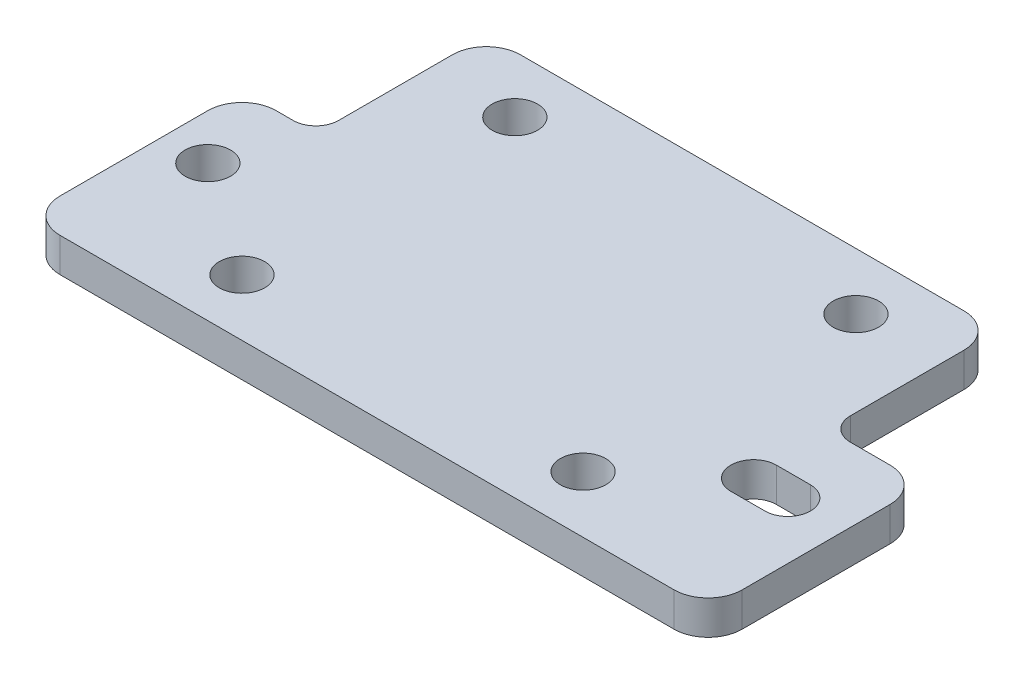
ISO-10303-21;
HEADER;
FILE_DESCRIPTION(('STEP AP214'),'2;1');
FILE_NAME('part.step','',(''),(''),'','','');
FILE_SCHEMA(('AUTOMOTIVE_DESIGN { 1 0 10303 214 1 1 1 1 }'));
ENDSEC;
DATA;
#1=APPLICATION_CONTEXT('core data for automotive mechanical design processes');
#2=APPLICATION_PROTOCOL_DEFINITION('international standard','automotive_design',2000,#1);
#3=PRODUCT_CONTEXT('',#1,'mechanical');
#4=PRODUCT('Part','Part','',(#3));
#5=PRODUCT_RELATED_PRODUCT_CATEGORY('part','',(#4));
#6=PRODUCT_DEFINITION_FORMATION('','',#4);
#7=PRODUCT_DEFINITION_CONTEXT('part definition',#1,'design');
#8=PRODUCT_DEFINITION('design','',#6,#7);
#9=PRODUCT_DEFINITION_SHAPE('','',#8);
#10=(LENGTH_UNIT() NAMED_UNIT(*) SI_UNIT(.MILLI.,.METRE.));
#11=(NAMED_UNIT(*) PLANE_ANGLE_UNIT() SI_UNIT($,.RADIAN.));
#12=(NAMED_UNIT(*) SI_UNIT($,.STERADIAN.) SOLID_ANGLE_UNIT());
#13=UNCERTAINTY_MEASURE_WITH_UNIT(LENGTH_MEASURE(1.E-05),#10,'distance_accuracy_value','');
#14=(GEOMETRIC_REPRESENTATION_CONTEXT(3) GLOBAL_UNCERTAINTY_ASSIGNED_CONTEXT((#13)) GLOBAL_UNIT_ASSIGNED_CONTEXT((#10,
#11,#12)) REPRESENTATION_CONTEXT('',''));
#15=CARTESIAN_POINT('',(0.,0.,0.));
#16=DIRECTION('',(0.,0.,1.));
#17=DIRECTION('',(1.,0.,0.));
#18=AXIS2_PLACEMENT_3D('',#15,#16,#17);
#19=CARTESIAN_POINT('',(23.,3.,5.));
#20=DIRECTION('',(0.,-1.,0.));
#21=DIRECTION('',(0.,0.,-1.));
#22=AXIS2_PLACEMENT_3D('',#19,#20,#21);
#23=CYLINDRICAL_SURFACE('',#22,2.);
#24=CARTESIAN_POINT('',(23.,0.,5.));
#25=DIRECTION('',(0.,1.,0.));
#26=DIRECTION('',(0.,0.,1.));
#27=AXIS2_PLACEMENT_3D('',#24,#25,#26);
#28=CIRCLE('',#27,2.);
#29=CARTESIAN_POINT('',(23.,0.,3.));
#30=VERTEX_POINT('',#29);
#31=CARTESIAN_POINT('',(23.,0.,7.));
#32=VERTEX_POINT('',#31);
#33=EDGE_CURVE('E175',#30,#32,#28,.T.);
#34=ORIENTED_EDGE('',*,*,#33,.F.);
#35=DIRECTION('',(0.,-1.,0.));
#36=VECTOR('',#35,1.);
#37=CARTESIAN_POINT('',(23.,3.,3.));
#38=LINE('',#37,#36);
#39=CARTESIAN_POINT('',(23.,3.,3.));
#40=VERTEX_POINT('',#39);
#41=EDGE_CURVE('E169',#40,#30,#38,.T.);
#42=ORIENTED_EDGE('',*,*,#41,.F.);
#43=CARTESIAN_POINT('',(23.,3.,5.));
#44=DIRECTION('',(0.,1.,0.));
#45=DIRECTION('',(0.,0.,1.));
#46=AXIS2_PLACEMENT_3D('',#43,#44,#45);
#47=CIRCLE('',#46,2.);
#48=CARTESIAN_POINT('',(23.,3.,7.));
#49=VERTEX_POINT('',#48);
#50=EDGE_CURVE('E172',#40,#49,#47,.T.);
#51=ORIENTED_EDGE('',*,*,#50,.T.);
#52=DIRECTION('',(0.,-1.,0.));
#53=VECTOR('',#52,1.);
#54=CARTESIAN_POINT('',(23.,3.,7.));
#55=LINE('',#54,#53);
#56=EDGE_CURVE('E218',#49,#32,#55,.T.);
#57=ORIENTED_EDGE('',*,*,#56,.T.);
#58=EDGE_LOOP('',(#34,#42,#51,#57));
#59=FACE_BOUND('',#58,.T.);
#60=ADVANCED_FACE('F34',(#59),#23,.F.);
#61=CARTESIAN_POINT('',(0.,3.,3.));
#62=DIRECTION('',(0.,0.,-1.));
#63=DIRECTION('',(-1.,0.,0.));
#64=AXIS2_PLACEMENT_3D('',#61,#62,#63);
#65=PLANE('',#64);
#66=DIRECTION('',(1.,0.,0.));
#67=VECTOR('',#66,1.);
#68=CARTESIAN_POINT('',(0.,0.,3.));
#69=LINE('',#68,#67);
#70=CARTESIAN_POINT('',(26.,0.,3.));
#71=VERTEX_POINT('',#70);
#72=EDGE_CURVE('E241',#30,#71,#69,.T.);
#73=ORIENTED_EDGE('',*,*,#72,.T.);
#74=DIRECTION('',(0.,-1.,0.));
#75=VECTOR('',#74,1.);
#76=CARTESIAN_POINT('',(26.,3.,3.));
#77=LINE('',#76,#75);
#78=CARTESIAN_POINT('',(26.,3.,3.));
#79=VERTEX_POINT('',#78);
#80=EDGE_CURVE('E180',#79,#71,#77,.T.);
#81=ORIENTED_EDGE('',*,*,#80,.F.);
#82=DIRECTION('',(1.,0.,0.));
#83=VECTOR('',#82,1.);
#84=CARTESIAN_POINT('',(0.,3.,3.));
#85=LINE('',#84,#83);
#86=EDGE_CURVE('E183',#40,#79,#85,.T.);
#87=ORIENTED_EDGE('',*,*,#86,.F.);
#88=ORIENTED_EDGE('',*,*,#41,.T.);
#89=EDGE_LOOP('',(#73,#81,#87,#88));
#90=FACE_BOUND('',#89,.T.);
#91=ADVANCED_FACE('F184',(#90),#65,.F.);
#92=CARTESIAN_POINT('',(26.,3.,5.));
#93=DIRECTION('',(0.,-1.,0.));
#94=DIRECTION('',(0.,0.,-1.));
#95=AXIS2_PLACEMENT_3D('',#92,#93,#94);
#96=CYLINDRICAL_SURFACE('',#95,2.);
#97=CARTESIAN_POINT('',(26.,0.,5.));
#98=DIRECTION('',(0.,1.,0.));
#99=DIRECTION('',(0.,0.,1.));
#100=AXIS2_PLACEMENT_3D('',#97,#98,#99);
#101=CIRCLE('',#100,2.);
#102=CARTESIAN_POINT('',(26.,0.,7.));
#103=VERTEX_POINT('',#102);
#104=EDGE_CURVE('E243',#103,#71,#101,.T.);
#105=ORIENTED_EDGE('',*,*,#104,.F.);
#106=DIRECTION('',(0.,-1.,0.));
#107=VECTOR('',#106,1.);
#108=CARTESIAN_POINT('',(26.,3.,7.));
#109=LINE('',#108,#107);
#110=CARTESIAN_POINT('',(26.,3.,7.));
#111=VERTEX_POINT('',#110);
#112=EDGE_CURVE('E266',#111,#103,#109,.T.);
#113=ORIENTED_EDGE('',*,*,#112,.F.);
#114=CARTESIAN_POINT('',(26.,3.,5.));
#115=DIRECTION('',(0.,1.,0.));
#116=DIRECTION('',(0.,0.,1.));
#117=AXIS2_PLACEMENT_3D('',#114,#115,#116);
#118=CIRCLE('',#117,2.);
#119=EDGE_CURVE('E188',#111,#79,#118,.T.);
#120=ORIENTED_EDGE('',*,*,#119,.T.);
#121=ORIENTED_EDGE('',*,*,#80,.T.);
#122=EDGE_LOOP('',(#105,#113,#120,#121));
#123=FACE_BOUND('',#122,.T.);
#124=ADVANCED_FACE('F415',(#123),#96,.F.);
#125=CARTESIAN_POINT('',(0.,3.,-2.));
#126=DIRECTION('',(0.,0.,-1.));
#127=DIRECTION('',(-1.,0.,0.));
#128=AXIS2_PLACEMENT_3D('',#125,#126,#127);
#129=PLANE('',#128);
#130=DIRECTION('',(1.,0.,0.));
#131=VECTOR('',#130,1.);
#132=CARTESIAN_POINT('',(0.,0.,-2.));
#133=LINE('',#132,#131);
#134=CARTESIAN_POINT('',(24.5,0.,-2.));
#135=VERTEX_POINT('',#134);
#136=CARTESIAN_POINT('',(28.,0.,-2.));
#137=VERTEX_POINT('',#136);
#138=EDGE_CURVE('E219',#135,#137,#133,.T.);
#139=ORIENTED_EDGE('',*,*,#138,.F.);
#140=DIRECTION('',(0.,-1.,0.));
#141=VECTOR('',#140,1.);
#142=CARTESIAN_POINT('',(24.5,3.,-2.));
#143=LINE('',#142,#141);
#144=CARTESIAN_POINT('',(24.5,3.,-2.));
#145=VERTEX_POINT('',#144);
#146=EDGE_CURVE('E55',#135,#145,#143,.F.);
#147=ORIENTED_EDGE('',*,*,#146,.T.);
#148=DIRECTION('',(1.,0.,0.));
#149=VECTOR('',#148,1.);
#150=CARTESIAN_POINT('',(0.,3.,-2.));
#151=LINE('',#150,#149);
#152=CARTESIAN_POINT('',(28.,3.,-2.));
#153=VERTEX_POINT('',#152);
#154=EDGE_CURVE('E264',#145,#153,#151,.T.);
#155=ORIENTED_EDGE('',*,*,#154,.T.);
#156=DIRECTION('',(0.,-1.,0.));
#157=VECTOR('',#156,1.);
#158=CARTESIAN_POINT('',(28.,0.,-2.));
#159=LINE('',#158,#157);
#160=EDGE_CURVE('E315',#153,#137,#159,.T.);
#161=ORIENTED_EDGE('',*,*,#160,.T.);
#162=EDGE_LOOP('',(#139,#147,#155,#161));
#163=FACE_BOUND('',#162,.T.);
#164=ADVANCED_FACE('F413',(#163),#129,.T.);
#165=CARTESIAN_POINT('',(22.5,3.,0.));
#166=DIRECTION('',(-1.,0.,0.));
#167=DIRECTION('',(0.,0.,1.));
#168=AXIS2_PLACEMENT_3D('',#165,#166,#167);
#169=PLANE('',#168);
#170=DIRECTION('',(0.,0.,-1.));
#171=VECTOR('',#170,1.);
#172=CARTESIAN_POINT('',(22.5,3.,0.));
#173=LINE('',#172,#171);
#174=CARTESIAN_POINT('',(22.5,3.,-4.));
#175=VERTEX_POINT('',#174);
#176=CARTESIAN_POINT('',(22.5,3.,-14.));
#177=VERTEX_POINT('',#176);
#178=EDGE_CURVE('E384',#175,#177,#173,.T.);
#179=ORIENTED_EDGE('',*,*,#178,.F.);
#180=DIRECTION('',(0.,-1.,0.));
#181=VECTOR('',#180,1.);
#182=CARTESIAN_POINT('',(22.5,3.,-4.));
#183=LINE('',#182,#181);
#184=CARTESIAN_POINT('',(22.5,0.,-4.));
#185=VERTEX_POINT('',#184);
#186=EDGE_CURVE('E331',#175,#185,#183,.T.);
#187=ORIENTED_EDGE('',*,*,#186,.T.);
#188=DIRECTION('',(0.,0.,-1.));
#189=VECTOR('',#188,1.);
#190=CARTESIAN_POINT('',(22.5,0.,0.));
#191=LINE('',#190,#189);
#192=CARTESIAN_POINT('',(22.5,0.,-14.));
#193=VERTEX_POINT('',#192);
#194=EDGE_CURVE('E221',#185,#193,#191,.T.);
#195=ORIENTED_EDGE('',*,*,#194,.T.);
#196=DIRECTION('',(0.,-1.,0.));
#197=VECTOR('',#196,1.);
#198=CARTESIAN_POINT('',(22.5,3.,-14.));
#199=LINE('',#198,#197);
#200=EDGE_CURVE('E323',#193,#177,#199,.F.);
#201=ORIENTED_EDGE('',*,*,#200,.T.);
#202=EDGE_LOOP('',(#179,#187,#195,#201));
#203=FACE_BOUND('',#202,.T.);
#204=ADVANCED_FACE('F382',(#203),#169,.F.);
#205=CARTESIAN_POINT('',(0.,3.,-17.));
#206=DIRECTION('',(0.,0.,-1.));
#207=DIRECTION('',(-1.,0.,0.));
#208=AXIS2_PLACEMENT_3D('',#205,#206,#207);
#209=PLANE('',#208);
#210=DIRECTION('',(1.,0.,0.));
#211=VECTOR('',#210,1.);
#212=CARTESIAN_POINT('',(0.,0.,-17.));
#213=LINE('',#212,#211);
#214=CARTESIAN_POINT('',(-19.5,0.,-17.));
#215=VERTEX_POINT('',#214);
#216=CARTESIAN_POINT('',(19.5,0.,-17.));
#217=VERTEX_POINT('',#216);
#218=EDGE_CURVE('E223',#215,#217,#213,.T.);
#219=ORIENTED_EDGE('',*,*,#218,.F.);
#220=DIRECTION('',(0.,-1.,0.));
#221=VECTOR('',#220,1.);
#222=CARTESIAN_POINT('',(-19.5,3.,-17.));
#223=LINE('',#222,#221);
#224=CARTESIAN_POINT('',(-19.5,3.,-17.));
#225=VERTEX_POINT('',#224);
#226=EDGE_CURVE('E313',#215,#225,#223,.F.);
#227=ORIENTED_EDGE('',*,*,#226,.T.);
#228=DIRECTION('',(1.,0.,0.));
#229=VECTOR('',#228,1.);
#230=CARTESIAN_POINT('',(0.,3.,-17.));
#231=LINE('',#230,#229);
#232=CARTESIAN_POINT('',(19.5,3.,-17.));
#233=VERTEX_POINT('',#232);
#234=EDGE_CURVE('E375',#225,#233,#231,.T.);
#235=ORIENTED_EDGE('',*,*,#234,.T.);
#236=DIRECTION('',(0.,-1.,0.));
#237=VECTOR('',#236,1.);
#238=CARTESIAN_POINT('',(19.5,0.,-17.));
#239=LINE('',#238,#237);
#240=EDGE_CURVE('E310',#233,#217,#239,.T.);
#241=ORIENTED_EDGE('',*,*,#240,.T.);
#242=EDGE_LOOP('',(#219,#227,#235,#241));
#243=FACE_BOUND('',#242,.T.);
#244=ADVANCED_FACE('F371',(#243),#209,.T.);
#245=CARTESIAN_POINT('',(-22.5,3.,0.));
#246=DIRECTION('',(-1.,0.,0.));
#247=DIRECTION('',(0.,0.,1.));
#248=AXIS2_PLACEMENT_3D('',#245,#246,#247);
#249=PLANE('',#248);
#250=DIRECTION('',(0.,0.,-1.));
#251=VECTOR('',#250,1.);
#252=CARTESIAN_POINT('',(-22.5,0.,0.));
#253=LINE('',#252,#251);
#254=CARTESIAN_POINT('',(-22.5,0.,-4.));
#255=VERTEX_POINT('',#254);
#256=CARTESIAN_POINT('',(-22.5,0.,-14.));
#257=VERTEX_POINT('',#256);
#258=EDGE_CURVE('E226',#255,#257,#253,.T.);
#259=ORIENTED_EDGE('',*,*,#258,.F.);
#260=DIRECTION('',(0.,-1.,0.));
#261=VECTOR('',#260,1.);
#262=CARTESIAN_POINT('',(-22.5,3.,-4.));
#263=LINE('',#262,#261);
#264=CARTESIAN_POINT('',(-22.5,3.,-4.));
#265=VERTEX_POINT('',#264);
#266=EDGE_CURVE('E329',#255,#265,#263,.F.);
#267=ORIENTED_EDGE('',*,*,#266,.T.);
#268=DIRECTION('',(0.,0.,-1.));
#269=VECTOR('',#268,1.);
#270=CARTESIAN_POINT('',(-22.5,3.,0.));
#271=LINE('',#270,#269);
#272=CARTESIAN_POINT('',(-22.5,3.,-14.));
#273=VERTEX_POINT('',#272);
#274=EDGE_CURVE('E346',#265,#273,#271,.T.);
#275=ORIENTED_EDGE('',*,*,#274,.T.);
#276=DIRECTION('',(0.,-1.,0.));
#277=VECTOR('',#276,1.);
#278=CARTESIAN_POINT('',(-22.5,3.,-14.));
#279=LINE('',#278,#277);
#280=EDGE_CURVE('E307',#273,#257,#279,.T.);
#281=ORIENTED_EDGE('',*,*,#280,.T.);
#282=EDGE_LOOP('',(#259,#267,#275,#281));
#283=FACE_BOUND('',#282,.T.);
#284=ADVANCED_FACE('F363',(#283),#249,.T.);
#285=CARTESIAN_POINT('',(0.,3.,-2.));
#286=DIRECTION('',(0.,0.,-1.));
#287=DIRECTION('',(-1.,0.,0.));
#288=AXIS2_PLACEMENT_3D('',#285,#286,#287);
#289=PLANE('',#288);
#290=DIRECTION('',(1.,0.,0.));
#291=VECTOR('',#290,1.);
#292=CARTESIAN_POINT('',(0.,3.,-2.));
#293=LINE('',#292,#291);
#294=CARTESIAN_POINT('',(-26.,3.,-2.));
#295=VERTEX_POINT('',#294);
#296=CARTESIAN_POINT('',(-24.5,3.,-2.));
#297=VERTEX_POINT('',#296);
#298=EDGE_CURVE('E344',#295,#297,#293,.T.);
#299=ORIENTED_EDGE('',*,*,#298,.T.);
#300=DIRECTION('',(0.,-1.,0.));
#301=VECTOR('',#300,1.);
#302=CARTESIAN_POINT('',(-24.5,0.,-2.));
#303=LINE('',#302,#301);
#304=CARTESIAN_POINT('',(-24.5,0.,-2.));
#305=VERTEX_POINT('',#304);
#306=EDGE_CURVE('E326',#297,#305,#303,.T.);
#307=ORIENTED_EDGE('',*,*,#306,.T.);
#308=DIRECTION('',(1.,0.,0.));
#309=VECTOR('',#308,1.);
#310=CARTESIAN_POINT('',(0.,0.,-2.));
#311=LINE('',#310,#309);
#312=CARTESIAN_POINT('',(-26.,0.,-2.));
#313=VERTEX_POINT('',#312);
#314=EDGE_CURVE('E228',#313,#305,#311,.T.);
#315=ORIENTED_EDGE('',*,*,#314,.F.);
#316=DIRECTION('',(0.,-1.,0.));
#317=VECTOR('',#316,1.);
#318=CARTESIAN_POINT('',(-26.,3.,-2.));
#319=LINE('',#318,#317);
#320=EDGE_CURVE('E305',#313,#295,#319,.F.);
#321=ORIENTED_EDGE('',*,*,#320,.T.);
#322=EDGE_LOOP('',(#299,#307,#315,#321));
#323=FACE_BOUND('',#322,.T.);
#324=ADVANCED_FACE('F351',(#323),#289,.T.);
#325=CARTESIAN_POINT('',(-29.,3.,0.));
#326=DIRECTION('',(-1.,0.,0.));
#327=DIRECTION('',(0.,0.,1.));
#328=AXIS2_PLACEMENT_3D('',#325,#326,#327);
#329=PLANE('',#328);
#330=DIRECTION('',(0.,0.,-1.));
#331=VECTOR('',#330,1.);
#332=CARTESIAN_POINT('',(-29.,0.,0.));
#333=LINE('',#332,#331);
#334=CARTESIAN_POINT('',(-29.,0.,14.));
#335=VERTEX_POINT('',#334);
#336=CARTESIAN_POINT('',(-29.,0.,1.));
#337=VERTEX_POINT('',#336);
#338=EDGE_CURVE('E231',#335,#337,#333,.T.);
#339=ORIENTED_EDGE('',*,*,#338,.F.);
#340=DIRECTION('',(0.,-1.,0.));
#341=VECTOR('',#340,1.);
#342=CARTESIAN_POINT('',(-29.,3.,14.));
#343=LINE('',#342,#341);
#344=CARTESIAN_POINT('',(-29.,3.,14.));
#345=VERTEX_POINT('',#344);
#346=EDGE_CURVE('E289',#335,#345,#343,.F.);
#347=ORIENTED_EDGE('',*,*,#346,.T.);
#348=DIRECTION('',(0.,0.,-1.));
#349=VECTOR('',#348,1.);
#350=CARTESIAN_POINT('',(-29.,3.,0.));
#351=LINE('',#350,#349);
#352=CARTESIAN_POINT('',(-29.,3.,1.));
#353=VERTEX_POINT('',#352);
#354=EDGE_CURVE('E354',#345,#353,#351,.T.);
#355=ORIENTED_EDGE('',*,*,#354,.T.);
#356=DIRECTION('',(0.,-1.,0.));
#357=VECTOR('',#356,1.);
#358=CARTESIAN_POINT('',(-29.,3.,1.));
#359=LINE('',#358,#357);
#360=EDGE_CURVE('E286',#353,#337,#359,.T.);
#361=ORIENTED_EDGE('',*,*,#360,.T.);
#362=EDGE_LOOP('',(#339,#347,#355,#361));
#363=FACE_BOUND('',#362,.T.);
#364=ADVANCED_FACE('F440',(#363),#329,.T.);
#365=CARTESIAN_POINT('',(0.,3.,17.));
#366=DIRECTION('',(0.,0.,-1.));
#367=DIRECTION('',(-1.,0.,0.));
#368=AXIS2_PLACEMENT_3D('',#365,#366,#367);
#369=PLANE('',#368);
#370=DIRECTION('',(1.,0.,0.));
#371=VECTOR('',#370,1.);
#372=CARTESIAN_POINT('',(0.,3.,17.));
#373=LINE('',#372,#371);
#374=CARTESIAN_POINT('',(-26.,3.,17.));
#375=VERTEX_POINT('',#374);
#376=CARTESIAN_POINT('',(28.,3.,17.));
#377=VERTEX_POINT('',#376);
#378=EDGE_CURVE('E197',#375,#377,#373,.T.);
#379=ORIENTED_EDGE('',*,*,#378,.F.);
#380=DIRECTION('',(0.,-1.,0.));
#381=VECTOR('',#380,1.);
#382=CARTESIAN_POINT('',(-26.,0.,17.));
#383=LINE('',#382,#381);
#384=CARTESIAN_POINT('',(-26.,0.,17.));
#385=VERTEX_POINT('',#384);
#386=EDGE_CURVE('E270',#375,#385,#383,.T.);
#387=ORIENTED_EDGE('',*,*,#386,.T.);
#388=DIRECTION('',(1.,0.,0.));
#389=VECTOR('',#388,1.);
#390=CARTESIAN_POINT('',(0.,0.,17.));
#391=LINE('',#390,#389);
#392=CARTESIAN_POINT('',(28.,0.,17.));
#393=VERTEX_POINT('',#392);
#394=EDGE_CURVE('E234',#385,#393,#391,.T.);
#395=ORIENTED_EDGE('',*,*,#394,.T.);
#396=DIRECTION('',(0.,-1.,0.));
#397=VECTOR('',#396,1.);
#398=CARTESIAN_POINT('',(28.,3.,17.));
#399=LINE('',#398,#397);
#400=EDGE_CURVE('E179',#393,#377,#399,.F.);
#401=ORIENTED_EDGE('',*,*,#400,.T.);
#402=EDGE_LOOP('',(#379,#387,#395,#401));
#403=FACE_BOUND('',#402,.T.);
#404=ADVANCED_FACE('F436',(#403),#369,.F.);
#405=CARTESIAN_POINT('',(-15.,3.,-12.));
#406=DIRECTION('',(0.,-1.,0.));
#407=DIRECTION('',(0.,0.,-1.));
#408=AXIS2_PLACEMENT_3D('',#405,#406,#407);
#409=CYLINDRICAL_SURFACE('',#408,2.);
#410=CARTESIAN_POINT('',(-15.,3.,-12.));
#411=DIRECTION('',(0.,1.,0.));
#412=DIRECTION('',(0.,0.,1.));
#413=AXIS2_PLACEMENT_3D('',#410,#411,#412);
#414=CIRCLE('',#413,2.);
#415=CARTESIAN_POINT('',(-15.,3.,-10.));
#416=VERTEX_POINT('',#415);
#417=EDGE_CURVE('E212',#416,#416,#414,.T.);
#418=ORIENTED_EDGE('',*,*,#417,.T.);
#419=EDGE_LOOP('',(#418));
#420=FACE_BOUND('',#419,.T.);
#421=CARTESIAN_POINT('',(-15.,0.,-12.));
#422=DIRECTION('',(0.,1.,0.));
#423=DIRECTION('',(0.,0.,1.));
#424=AXIS2_PLACEMENT_3D('',#421,#422,#423);
#425=CIRCLE('',#424,2.);
#426=CARTESIAN_POINT('',(-15.,0.,-10.));
#427=VERTEX_POINT('',#426);
#428=EDGE_CURVE('E258',#427,#427,#425,.T.);
#429=ORIENTED_EDGE('',*,*,#428,.F.);
#430=EDGE_LOOP('',(#429));
#431=FACE_BOUND('',#430,.T.);
#432=ADVANCED_FACE('F439',(#420,#431),#409,.F.);
#433=CARTESIAN_POINT('',(-25.,3.,5.));
#434=DIRECTION('',(0.,-1.,0.));
#435=DIRECTION('',(0.,0.,-1.));
#436=AXIS2_PLACEMENT_3D('',#433,#434,#435);
#437=CYLINDRICAL_SURFACE('',#436,2.);
#438=CARTESIAN_POINT('',(-25.,3.,5.));
#439=DIRECTION('',(0.,1.,0.));
#440=DIRECTION('',(0.,0.,1.));
#441=AXIS2_PLACEMENT_3D('',#438,#439,#440);
#442=CIRCLE('',#441,2.);
#443=CARTESIAN_POINT('',(-25.,3.,7.));
#444=VERTEX_POINT('',#443);
#445=EDGE_CURVE('E209',#444,#444,#442,.T.);
#446=ORIENTED_EDGE('',*,*,#445,.T.);
#447=EDGE_LOOP('',(#446));
#448=FACE_BOUND('',#447,.T.);
#449=CARTESIAN_POINT('',(-25.,0.,5.));
#450=DIRECTION('',(0.,1.,0.));
#451=DIRECTION('',(0.,0.,1.));
#452=AXIS2_PLACEMENT_3D('',#449,#450,#451);
#453=CIRCLE('',#452,2.);
#454=CARTESIAN_POINT('',(-25.,0.,7.));
#455=VERTEX_POINT('',#454);
#456=EDGE_CURVE('E255',#455,#455,#453,.T.);
#457=ORIENTED_EDGE('',*,*,#456,.F.);
#458=EDGE_LOOP('',(#457));
#459=FACE_BOUND('',#458,.T.);
#460=ADVANCED_FACE('F478',(#448,#459),#437,.F.);
#461=CARTESIAN_POINT('',(-15.,3.,12.));
#462=DIRECTION('',(0.,-1.,0.));
#463=DIRECTION('',(0.,0.,-1.));
#464=AXIS2_PLACEMENT_3D('',#461,#462,#463);
#465=CYLINDRICAL_SURFACE('',#464,2.);
#466=CARTESIAN_POINT('',(-15.,3.,12.));
#467=DIRECTION('',(0.,1.,0.));
#468=DIRECTION('',(0.,0.,1.));
#469=AXIS2_PLACEMENT_3D('',#466,#467,#468);
#470=CIRCLE('',#469,2.);
#471=CARTESIAN_POINT('',(-15.,3.,14.));
#472=VERTEX_POINT('',#471);
#473=EDGE_CURVE('E206',#472,#472,#470,.F.);
#474=ORIENTED_EDGE('',*,*,#473,.F.);
#475=EDGE_LOOP('',(#474));
#476=FACE_BOUND('',#475,.T.);
#477=CARTESIAN_POINT('',(-15.,0.,12.));
#478=DIRECTION('',(0.,1.,0.));
#479=DIRECTION('',(0.,0.,1.));
#480=AXIS2_PLACEMENT_3D('',#477,#478,#479);
#481=CIRCLE('',#480,2.);
#482=CARTESIAN_POINT('',(-15.,0.,14.));
#483=VERTEX_POINT('',#482);
#484=EDGE_CURVE('E252',#483,#483,#481,.F.);
#485=ORIENTED_EDGE('',*,*,#484,.T.);
#486=EDGE_LOOP('',(#485));
#487=FACE_BOUND('',#486,.T.);
#488=ADVANCED_FACE('F487',(#476,#487),#465,.F.);
#489=CARTESIAN_POINT('',(15.,3.,12.));
#490=DIRECTION('',(0.,-1.,0.));
#491=DIRECTION('',(0.,0.,-1.));
#492=AXIS2_PLACEMENT_3D('',#489,#490,#491);
#493=CYLINDRICAL_SURFACE('',#492,2.);
#494=CARTESIAN_POINT('',(15.,3.,12.));
#495=DIRECTION('',(0.,1.,0.));
#496=DIRECTION('',(0.,0.,1.));
#497=AXIS2_PLACEMENT_3D('',#494,#495,#496);
#498=CIRCLE('',#497,2.);
#499=CARTESIAN_POINT('',(15.,3.,14.));
#500=VERTEX_POINT('',#499);
#501=EDGE_CURVE('E203',#500,#500,#498,.T.);
#502=ORIENTED_EDGE('',*,*,#501,.T.);
#503=EDGE_LOOP('',(#502));
#504=FACE_BOUND('',#503,.T.);
#505=CARTESIAN_POINT('',(15.,0.,12.));
#506=DIRECTION('',(0.,1.,0.));
#507=DIRECTION('',(0.,0.,1.));
#508=AXIS2_PLACEMENT_3D('',#505,#506,#507);
#509=CIRCLE('',#508,2.);
#510=CARTESIAN_POINT('',(15.,0.,14.));
#511=VERTEX_POINT('',#510);
#512=EDGE_CURVE('E249',#511,#511,#509,.T.);
#513=ORIENTED_EDGE('',*,*,#512,.F.);
#514=EDGE_LOOP('',(#513));
#515=FACE_BOUND('',#514,.T.);
#516=ADVANCED_FACE('F495',(#504,#515),#493,.F.);
#517=CARTESIAN_POINT('',(0.,3.,7.));
#518=DIRECTION('',(0.,0.,-1.));
#519=DIRECTION('',(-1.,0.,0.));
#520=AXIS2_PLACEMENT_3D('',#517,#518,#519);
#521=PLANE('',#520);
#522=DIRECTION('',(1.,0.,0.));
#523=VECTOR('',#522,1.);
#524=CARTESIAN_POINT('',(0.,0.,7.));
#525=LINE('',#524,#523);
#526=EDGE_CURVE('E246',#32,#103,#525,.T.);
#527=ORIENTED_EDGE('',*,*,#526,.F.);
#528=ORIENTED_EDGE('',*,*,#56,.F.);
#529=DIRECTION('',(1.,0.,0.));
#530=VECTOR('',#529,1.);
#531=CARTESIAN_POINT('',(0.,3.,7.));
#532=LINE('',#531,#530);
#533=EDGE_CURVE('E193',#49,#111,#532,.T.);
#534=ORIENTED_EDGE('',*,*,#533,.T.);
#535=ORIENTED_EDGE('',*,*,#112,.T.);
#536=EDGE_LOOP('',(#527,#528,#534,#535));
#537=FACE_BOUND('',#536,.T.);
#538=ADVANCED_FACE('F435',(#537),#521,.T.);
#539=CARTESIAN_POINT('',(31.,3.,0.));
#540=DIRECTION('',(-1.,0.,0.));
#541=DIRECTION('',(0.,0.,1.));
#542=AXIS2_PLACEMENT_3D('',#539,#540,#541);
#543=PLANE('',#542);
#544=DIRECTION('',(0.,0.,-1.));
#545=VECTOR('',#544,1.);
#546=CARTESIAN_POINT('',(31.,0.,0.));
#547=LINE('',#546,#545);
#548=CARTESIAN_POINT('',(31.,0.,14.));
#549=VERTEX_POINT('',#548);
#550=CARTESIAN_POINT('',(31.,0.,1.));
#551=VERTEX_POINT('',#550);
#552=EDGE_CURVE('E237',#549,#551,#547,.T.);
#553=ORIENTED_EDGE('',*,*,#552,.T.);
#554=DIRECTION('',(0.,-1.,0.));
#555=VECTOR('',#554,1.);
#556=CARTESIAN_POINT('',(31.,3.,1.));
#557=LINE('',#556,#555);
#558=CARTESIAN_POINT('',(31.,3.,1.));
#559=VERTEX_POINT('',#558);
#560=EDGE_CURVE('E321',#551,#559,#557,.F.);
#561=ORIENTED_EDGE('',*,*,#560,.T.);
#562=DIRECTION('',(0.,0.,-1.));
#563=VECTOR('',#562,1.);
#564=CARTESIAN_POINT('',(31.,3.,0.));
#565=LINE('',#564,#563);
#566=CARTESIAN_POINT('',(31.,3.,14.));
#567=VERTEX_POINT('',#566);
#568=EDGE_CURVE('E194',#567,#559,#565,.T.);
#569=ORIENTED_EDGE('',*,*,#568,.F.);
#570=DIRECTION('',(0.,-1.,0.));
#571=VECTOR('',#570,1.);
#572=CARTESIAN_POINT('',(31.,3.,14.));
#573=LINE('',#572,#571);
#574=EDGE_CURVE('E318',#567,#549,#573,.T.);
#575=ORIENTED_EDGE('',*,*,#574,.T.);
#576=EDGE_LOOP('',(#553,#561,#569,#575));
#577=FACE_BOUND('',#576,.T.);
#578=ADVANCED_FACE('F408',(#577),#543,.F.);
#579=CARTESIAN_POINT('',(15.,3.,-12.));
#580=DIRECTION('',(0.,-1.,0.));
#581=DIRECTION('',(0.,0.,-1.));
#582=AXIS2_PLACEMENT_3D('',#579,#580,#581);
#583=CYLINDRICAL_SURFACE('',#582,2.);
#584=CARTESIAN_POINT('',(15.,3.,-12.));
#585=DIRECTION('',(0.,1.,0.));
#586=DIRECTION('',(0.,0.,1.));
#587=AXIS2_PLACEMENT_3D('',#584,#585,#586);
#588=CIRCLE('',#587,2.);
#589=CARTESIAN_POINT('',(15.,3.,-10.));
#590=VERTEX_POINT('',#589);
#591=EDGE_CURVE('E215',#590,#590,#588,.F.);
#592=ORIENTED_EDGE('',*,*,#591,.F.);
#593=EDGE_LOOP('',(#592));
#594=FACE_BOUND('',#593,.T.);
#595=CARTESIAN_POINT('',(15.,0.,-12.));
#596=DIRECTION('',(0.,1.,0.));
#597=DIRECTION('',(0.,0.,1.));
#598=AXIS2_PLACEMENT_3D('',#595,#596,#597);
#599=CIRCLE('',#598,2.);
#600=CARTESIAN_POINT('',(15.,0.,-10.));
#601=VERTEX_POINT('',#600);
#602=EDGE_CURVE('E261',#601,#601,#599,.F.);
#603=ORIENTED_EDGE('',*,*,#602,.T.);
#604=EDGE_LOOP('',(#603));
#605=FACE_BOUND('',#604,.T.);
#606=ADVANCED_FACE('F434',(#594,#605),#583,.F.);
#607=CARTESIAN_POINT('',(0.,3.,0.));
#608=DIRECTION('',(0.,1.,0.));
#609=DIRECTION('',(0.,0.,1.));
#610=AXIS2_PLACEMENT_3D('',#607,#608,#609);
#611=PLANE('',#610);
#612=ORIENTED_EDGE('',*,*,#354,.F.);
#613=CARTESIAN_POINT('',(-26.,3.,14.));
#614=DIRECTION('',(0.,1.,0.));
#615=DIRECTION('',(0.,0.,1.));
#616=AXIS2_PLACEMENT_3D('',#613,#614,#615);
#617=CIRCLE('',#616,3.);
#618=EDGE_CURVE('E303',#345,#375,#617,.T.);
#619=ORIENTED_EDGE('',*,*,#618,.T.);
#620=ORIENTED_EDGE('',*,*,#378,.T.);
#621=CARTESIAN_POINT('',(28.,3.,14.));
#622=DIRECTION('',(0.,1.,0.));
#623=DIRECTION('',(0.,0.,1.));
#624=AXIS2_PLACEMENT_3D('',#621,#622,#623);
#625=CIRCLE('',#624,3.);
#626=EDGE_CURVE('E291',#377,#567,#625,.T.);
#627=ORIENTED_EDGE('',*,*,#626,.T.);
#628=ORIENTED_EDGE('',*,*,#568,.T.);
#629=CARTESIAN_POINT('',(28.,3.,1.));
#630=DIRECTION('',(0.,1.,0.));
#631=DIRECTION('',(0.,0.,1.));
#632=AXIS2_PLACEMENT_3D('',#629,#630,#631);
#633=CIRCLE('',#632,3.);
#634=EDGE_CURVE('E295',#559,#153,#633,.T.);
#635=ORIENTED_EDGE('',*,*,#634,.T.);
#636=ORIENTED_EDGE('',*,*,#154,.F.);
#637=CARTESIAN_POINT('',(24.5,3.,-4.));
#638=DIRECTION('',(0.,1.,0.));
#639=DIRECTION('',(0.,0.,1.));
#640=AXIS2_PLACEMENT_3D('',#637,#638,#639);
#641=CIRCLE('',#640,2.);
#642=EDGE_CURVE('E11',#145,#175,#641,.F.);
#643=ORIENTED_EDGE('',*,*,#642,.T.);
#644=ORIENTED_EDGE('',*,*,#178,.T.);
#645=CARTESIAN_POINT('',(19.5,3.,-14.));
#646=DIRECTION('',(0.,1.,0.));
#647=DIRECTION('',(0.,0.,1.));
#648=AXIS2_PLACEMENT_3D('',#645,#646,#647);
#649=CIRCLE('',#648,3.);
#650=EDGE_CURVE('E293',#177,#233,#649,.T.);
#651=ORIENTED_EDGE('',*,*,#650,.T.);
#652=ORIENTED_EDGE('',*,*,#234,.F.);
#653=CARTESIAN_POINT('',(-19.5,3.,-14.));
#654=DIRECTION('',(0.,1.,0.));
#655=DIRECTION('',(0.,0.,1.));
#656=AXIS2_PLACEMENT_3D('',#653,#654,#655);
#657=CIRCLE('',#656,3.);
#658=EDGE_CURVE('E298',#225,#273,#657,.T.);
#659=ORIENTED_EDGE('',*,*,#658,.T.);
#660=ORIENTED_EDGE('',*,*,#274,.F.);
#661=CARTESIAN_POINT('',(-24.5,3.,-4.));
#662=DIRECTION('',(0.,1.,0.));
#663=DIRECTION('',(0.,0.,1.));
#664=AXIS2_PLACEMENT_3D('',#661,#662,#663);
#665=CIRCLE('',#664,2.);
#666=EDGE_CURVE('E337',#265,#297,#665,.F.);
#667=ORIENTED_EDGE('',*,*,#666,.T.);
#668=ORIENTED_EDGE('',*,*,#298,.F.);
#669=CARTESIAN_POINT('',(-26.,3.,1.));
#670=DIRECTION('',(0.,1.,0.));
#671=DIRECTION('',(0.,0.,1.));
#672=AXIS2_PLACEMENT_3D('',#669,#670,#671);
#673=CIRCLE('',#672,3.);
#674=EDGE_CURVE('E301',#295,#353,#673,.T.);
#675=ORIENTED_EDGE('',*,*,#674,.T.);
#676=EDGE_LOOP('',(#612,#619,#620,#627,#628,#635,#636,#643,#644,#651,#652,#659,#660,#667,#668,#675));
#677=FACE_BOUND('',#676,.T.);
#678=ORIENTED_EDGE('',*,*,#50,.F.);
#679=ORIENTED_EDGE('',*,*,#86,.T.);
#680=ORIENTED_EDGE('',*,*,#119,.F.);
#681=ORIENTED_EDGE('',*,*,#533,.F.);
#682=EDGE_LOOP('',(#678,#679,#680,#681));
#683=FACE_BOUND('',#682,.T.);
#684=ORIENTED_EDGE('',*,*,#501,.F.);
#685=EDGE_LOOP('',(#684));
#686=FACE_BOUND('',#685,.T.);
#687=ORIENTED_EDGE('',*,*,#473,.T.);
#688=EDGE_LOOP('',(#687));
#689=FACE_BOUND('',#688,.T.);
#690=ORIENTED_EDGE('',*,*,#445,.F.);
#691=EDGE_LOOP('',(#690));
#692=FACE_BOUND('',#691,.T.);
#693=ORIENTED_EDGE('',*,*,#417,.F.);
#694=EDGE_LOOP('',(#693));
#695=FACE_BOUND('',#694,.T.);
#696=ORIENTED_EDGE('',*,*,#591,.T.);
#697=EDGE_LOOP('',(#696));
#698=FACE_BOUND('',#697,.T.);
#699=ADVANCED_FACE('F190',(#677,#683,#686,#689,#692,#695,#698),#611,.T.);
#700=CARTESIAN_POINT('',(0.,0.,0.));
#701=DIRECTION('',(0.,1.,0.));
#702=DIRECTION('',(0.,0.,1.));
#703=AXIS2_PLACEMENT_3D('',#700,#701,#702);
#704=PLANE('',#703);
#705=ORIENTED_EDGE('',*,*,#394,.F.);
#706=CARTESIAN_POINT('',(-26.,0.,14.));
#707=DIRECTION('',(0.,1.,0.));
#708=DIRECTION('',(0.,0.,1.));
#709=AXIS2_PLACEMENT_3D('',#706,#707,#708);
#710=CIRCLE('',#709,3.);
#711=EDGE_CURVE('E284',#385,#335,#710,.F.);
#712=ORIENTED_EDGE('',*,*,#711,.T.);
#713=ORIENTED_EDGE('',*,*,#338,.T.);
#714=CARTESIAN_POINT('',(-26.,0.,1.));
#715=DIRECTION('',(0.,1.,0.));
#716=DIRECTION('',(0.,0.,1.));
#717=AXIS2_PLACEMENT_3D('',#714,#715,#716);
#718=CIRCLE('',#717,3.);
#719=EDGE_CURVE('E282',#337,#313,#718,.F.);
#720=ORIENTED_EDGE('',*,*,#719,.T.);
#721=ORIENTED_EDGE('',*,*,#314,.T.);
#722=CARTESIAN_POINT('',(-24.5,0.,-4.));
#723=DIRECTION('',(0.,1.,0.));
#724=DIRECTION('',(0.,0.,1.));
#725=AXIS2_PLACEMENT_3D('',#722,#723,#724);
#726=CIRCLE('',#725,2.);
#727=EDGE_CURVE('E335',#305,#255,#726,.T.);
#728=ORIENTED_EDGE('',*,*,#727,.T.);
#729=ORIENTED_EDGE('',*,*,#258,.T.);
#730=CARTESIAN_POINT('',(-19.5,0.,-14.));
#731=DIRECTION('',(0.,1.,0.));
#732=DIRECTION('',(0.,0.,1.));
#733=AXIS2_PLACEMENT_3D('',#730,#731,#732);
#734=CIRCLE('',#733,3.);
#735=EDGE_CURVE('E280',#257,#215,#734,.F.);
#736=ORIENTED_EDGE('',*,*,#735,.T.);
#737=ORIENTED_EDGE('',*,*,#218,.T.);
#738=CARTESIAN_POINT('',(19.5,0.,-14.));
#739=DIRECTION('',(0.,1.,0.));
#740=DIRECTION('',(0.,0.,1.));
#741=AXIS2_PLACEMENT_3D('',#738,#739,#740);
#742=CIRCLE('',#741,3.);
#743=EDGE_CURVE('E275',#217,#193,#742,.F.);
#744=ORIENTED_EDGE('',*,*,#743,.T.);
#745=ORIENTED_EDGE('',*,*,#194,.F.);
#746=CARTESIAN_POINT('',(24.5,0.,-4.));
#747=DIRECTION('',(0.,1.,0.));
#748=DIRECTION('',(0.,0.,1.));
#749=AXIS2_PLACEMENT_3D('',#746,#747,#748);
#750=CIRCLE('',#749,2.);
#751=EDGE_CURVE('E42',#185,#135,#750,.T.);
#752=ORIENTED_EDGE('',*,*,#751,.T.);
#753=ORIENTED_EDGE('',*,*,#138,.T.);
#754=CARTESIAN_POINT('',(28.,0.,1.));
#755=DIRECTION('',(0.,1.,0.));
#756=DIRECTION('',(0.,0.,1.));
#757=AXIS2_PLACEMENT_3D('',#754,#755,#756);
#758=CIRCLE('',#757,3.);
#759=EDGE_CURVE('E278',#137,#551,#758,.F.);
#760=ORIENTED_EDGE('',*,*,#759,.T.);
#761=ORIENTED_EDGE('',*,*,#552,.F.);
#762=CARTESIAN_POINT('',(28.,0.,14.));
#763=DIRECTION('',(0.,1.,0.));
#764=DIRECTION('',(0.,0.,1.));
#765=AXIS2_PLACEMENT_3D('',#762,#763,#764);
#766=CIRCLE('',#765,3.);
#767=EDGE_CURVE('E273',#549,#393,#766,.F.);
#768=ORIENTED_EDGE('',*,*,#767,.T.);
#769=EDGE_LOOP('',(#705,#712,#713,#720,#721,#728,#729,#736,#737,#744,#745,#752,#753,#760,#761,#768));
#770=FACE_BOUND('',#769,.T.);
#771=ORIENTED_EDGE('',*,*,#33,.T.);
#772=ORIENTED_EDGE('',*,*,#526,.T.);
#773=ORIENTED_EDGE('',*,*,#104,.T.);
#774=ORIENTED_EDGE('',*,*,#72,.F.);
#775=EDGE_LOOP('',(#771,#772,#773,#774));
#776=FACE_BOUND('',#775,.T.);
#777=ORIENTED_EDGE('',*,*,#512,.T.);
#778=EDGE_LOOP('',(#777));
#779=FACE_BOUND('',#778,.T.);
#780=ORIENTED_EDGE('',*,*,#484,.F.);
#781=EDGE_LOOP('',(#780));
#782=FACE_BOUND('',#781,.T.);
#783=ORIENTED_EDGE('',*,*,#456,.T.);
#784=EDGE_LOOP('',(#783));
#785=FACE_BOUND('',#784,.T.);
#786=ORIENTED_EDGE('',*,*,#428,.T.);
#787=EDGE_LOOP('',(#786));
#788=FACE_BOUND('',#787,.T.);
#789=ORIENTED_EDGE('',*,*,#602,.F.);
#790=EDGE_LOOP('',(#789));
#791=FACE_BOUND('',#790,.T.);
#792=ADVANCED_FACE('F359',(#770,#776,#779,#782,#785,#788,#791),#704,.F.);
#793=CARTESIAN_POINT('',(-26.,3.,14.));
#794=DIRECTION('',(0.,1.,0.));
#795=DIRECTION('',(0.,0.,1.));
#796=AXIS2_PLACEMENT_3D('',#793,#794,#795);
#797=CYLINDRICAL_SURFACE('',#796,3.);
#798=ORIENTED_EDGE('',*,*,#618,.F.);
#799=ORIENTED_EDGE('',*,*,#346,.F.);
#800=ORIENTED_EDGE('',*,*,#711,.F.);
#801=ORIENTED_EDGE('',*,*,#386,.F.);
#802=EDGE_LOOP('',(#798,#799,#800,#801));
#803=FACE_BOUND('',#802,.T.);
#804=ADVANCED_FACE('F532',(#803),#797,.T.);
#805=CARTESIAN_POINT('',(-26.,3.,1.));
#806=DIRECTION('',(0.,-1.,0.));
#807=DIRECTION('',(0.,0.,-1.));
#808=AXIS2_PLACEMENT_3D('',#805,#806,#807);
#809=CYLINDRICAL_SURFACE('',#808,3.);
#810=ORIENTED_EDGE('',*,*,#674,.F.);
#811=ORIENTED_EDGE('',*,*,#320,.F.);
#812=ORIENTED_EDGE('',*,*,#719,.F.);
#813=ORIENTED_EDGE('',*,*,#360,.F.);
#814=EDGE_LOOP('',(#810,#811,#812,#813));
#815=FACE_BOUND('',#814,.T.);
#816=ADVANCED_FACE('F539',(#815),#809,.T.);
#817=CARTESIAN_POINT('',(-19.5,3.,-14.));
#818=DIRECTION('',(0.,-1.,0.));
#819=DIRECTION('',(0.,0.,-1.));
#820=AXIS2_PLACEMENT_3D('',#817,#818,#819);
#821=CYLINDRICAL_SURFACE('',#820,3.);
#822=ORIENTED_EDGE('',*,*,#658,.F.);
#823=ORIENTED_EDGE('',*,*,#226,.F.);
#824=ORIENTED_EDGE('',*,*,#735,.F.);
#825=ORIENTED_EDGE('',*,*,#280,.F.);
#826=EDGE_LOOP('',(#822,#823,#824,#825));
#827=FACE_BOUND('',#826,.T.);
#828=ADVANCED_FACE('F367',(#827),#821,.T.);
#829=CARTESIAN_POINT('',(28.,3.,1.));
#830=DIRECTION('',(0.,1.,0.));
#831=DIRECTION('',(0.,0.,1.));
#832=AXIS2_PLACEMENT_3D('',#829,#830,#831);
#833=CYLINDRICAL_SURFACE('',#832,3.);
#834=ORIENTED_EDGE('',*,*,#634,.F.);
#835=ORIENTED_EDGE('',*,*,#560,.F.);
#836=ORIENTED_EDGE('',*,*,#759,.F.);
#837=ORIENTED_EDGE('',*,*,#160,.F.);
#838=EDGE_LOOP('',(#834,#835,#836,#837));
#839=FACE_BOUND('',#838,.T.);
#840=ADVANCED_FACE('F412',(#839),#833,.T.);
#841=CARTESIAN_POINT('',(19.5,3.,-14.));
#842=DIRECTION('',(0.,1.,0.));
#843=DIRECTION('',(0.,0.,1.));
#844=AXIS2_PLACEMENT_3D('',#841,#842,#843);
#845=CYLINDRICAL_SURFACE('',#844,3.);
#846=ORIENTED_EDGE('',*,*,#650,.F.);
#847=ORIENTED_EDGE('',*,*,#200,.F.);
#848=ORIENTED_EDGE('',*,*,#743,.F.);
#849=ORIENTED_EDGE('',*,*,#240,.F.);
#850=EDGE_LOOP('',(#846,#847,#848,#849));
#851=FACE_BOUND('',#850,.T.);
#852=ADVANCED_FACE('F378',(#851),#845,.T.);
#853=CARTESIAN_POINT('',(28.,3.,14.));
#854=DIRECTION('',(0.,-1.,0.));
#855=DIRECTION('',(0.,0.,-1.));
#856=AXIS2_PLACEMENT_3D('',#853,#854,#855);
#857=CYLINDRICAL_SURFACE('',#856,3.);
#858=ORIENTED_EDGE('',*,*,#626,.F.);
#859=ORIENTED_EDGE('',*,*,#400,.F.);
#860=ORIENTED_EDGE('',*,*,#767,.F.);
#861=ORIENTED_EDGE('',*,*,#574,.F.);
#862=EDGE_LOOP('',(#858,#859,#860,#861));
#863=FACE_BOUND('',#862,.T.);
#864=ADVANCED_FACE('F405',(#863),#857,.T.);
#865=CARTESIAN_POINT('',(-24.5,3.,-4.));
#866=DIRECTION('',(0.,1.,0.));
#867=DIRECTION('',(0.,0.,1.));
#868=AXIS2_PLACEMENT_3D('',#865,#866,#867);
#869=CYLINDRICAL_SURFACE('',#868,2.);
#870=ORIENTED_EDGE('',*,*,#666,.F.);
#871=ORIENTED_EDGE('',*,*,#266,.F.);
#872=ORIENTED_EDGE('',*,*,#727,.F.);
#873=ORIENTED_EDGE('',*,*,#306,.F.);
#874=EDGE_LOOP('',(#870,#871,#872,#873));
#875=FACE_BOUND('',#874,.T.);
#876=ADVANCED_FACE('F356',(#875),#869,.F.);
#877=CARTESIAN_POINT('',(24.5,3.,-4.));
#878=DIRECTION('',(0.,-1.,0.));
#879=DIRECTION('',(0.,0.,-1.));
#880=AXIS2_PLACEMENT_3D('',#877,#878,#879);
#881=CYLINDRICAL_SURFACE('',#880,2.);
#882=ORIENTED_EDGE('',*,*,#642,.F.);
#883=ORIENTED_EDGE('',*,*,#146,.F.);
#884=ORIENTED_EDGE('',*,*,#751,.F.);
#885=ORIENTED_EDGE('',*,*,#186,.F.);
#886=EDGE_LOOP('',(#882,#883,#884,#885));
#887=FACE_BOUND('',#886,.T.);
#888=ADVANCED_FACE('F36',(#887),#881,.F.);
#889=CLOSED_SHELL('',(#60,#91,#124,#164,#204,#244,#284,#324,#364,#404,#432,#460,#488,#516,#538,
#578,#606,#699,#792,#804,#816,#828,#840,#852,#864,#876,#888));
#890=MANIFOLD_SOLID_BREP('B2',#889);
#891=ADVANCED_BREP_SHAPE_REPRESENTATION('',(#18,#890),#14);
#892=SHAPE_DEFINITION_REPRESENTATION(#9,#891);
ENDSEC;
END-ISO-10303-21;
